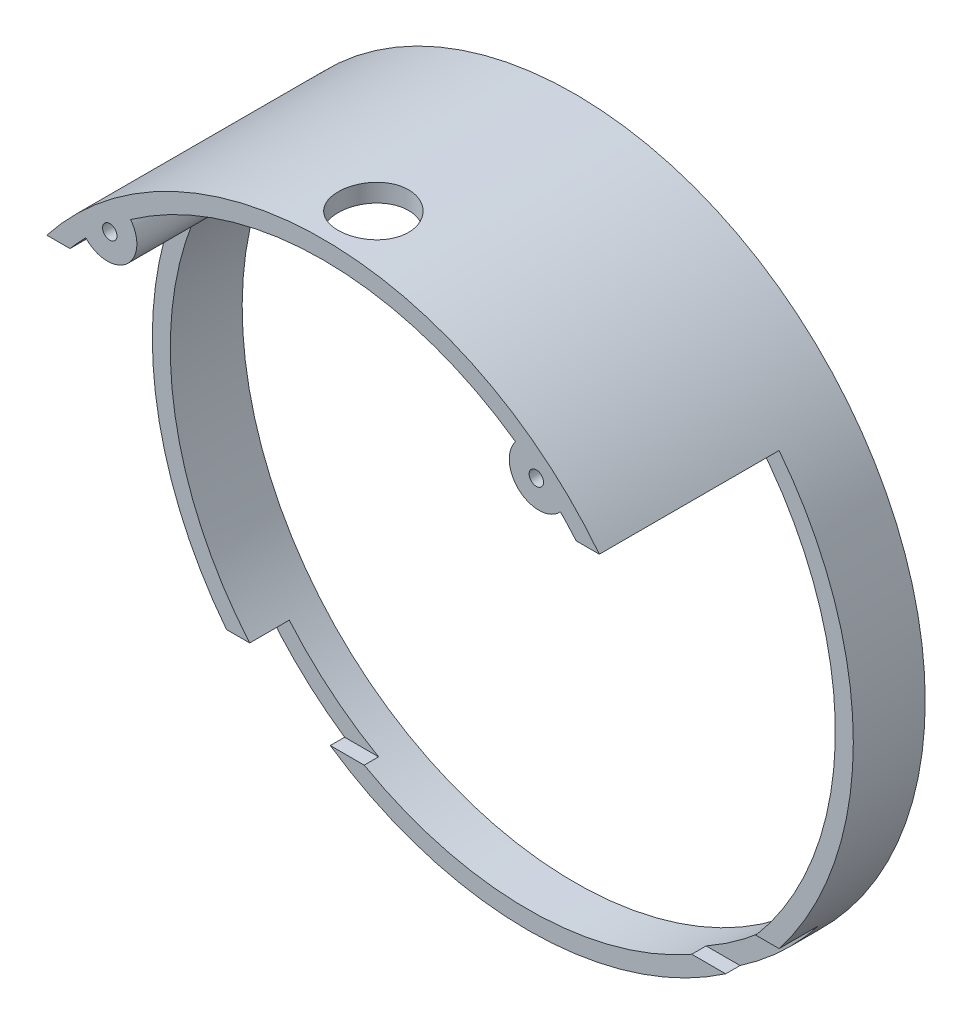
ISO-10303-21;
HEADER;
FILE_DESCRIPTION(('STEP AP214'),'2;1');
FILE_NAME('part.step','',(''),(''),'','','');
FILE_SCHEMA(('AUTOMOTIVE_DESIGN { 1 0 10303 214 1 1 1 1 }'));
ENDSEC;
DATA;
#1=APPLICATION_CONTEXT('core data for automotive mechanical design processes');
#2=APPLICATION_PROTOCOL_DEFINITION('international standard','automotive_design',2000,#1);
#3=PRODUCT_CONTEXT('',#1,'mechanical');
#4=PRODUCT('Part','Part','',(#3));
#5=PRODUCT_RELATED_PRODUCT_CATEGORY('part','',(#4));
#6=PRODUCT_DEFINITION_FORMATION('','',#4);
#7=PRODUCT_DEFINITION_CONTEXT('part definition',#1,'design');
#8=PRODUCT_DEFINITION('design','',#6,#7);
#9=PRODUCT_DEFINITION_SHAPE('','',#8);
#10=(LENGTH_UNIT() NAMED_UNIT(*) SI_UNIT(.MILLI.,.METRE.));
#11=(NAMED_UNIT(*) PLANE_ANGLE_UNIT() SI_UNIT($,.RADIAN.));
#12=(NAMED_UNIT(*) SI_UNIT($,.STERADIAN.) SOLID_ANGLE_UNIT());
#13=UNCERTAINTY_MEASURE_WITH_UNIT(LENGTH_MEASURE(1.E-05),#10,'distance_accuracy_value','');
#14=(GEOMETRIC_REPRESENTATION_CONTEXT(3) GLOBAL_UNCERTAINTY_ASSIGNED_CONTEXT((#13)) GLOBAL_UNIT_ASSIGNED_CONTEXT((#10,
#11,#12)) REPRESENTATION_CONTEXT('',''));
#15=CARTESIAN_POINT('',(0.,0.,0.));
#16=DIRECTION('',(0.,0.,1.));
#17=DIRECTION('',(1.,0.,0.));
#18=AXIS2_PLACEMENT_3D('',#15,#16,#17);
#19=CARTESIAN_POINT('',(0.,0.,70.));
#20=DIRECTION('',(0.,0.,-1.));
#21=DIRECTION('',(-1.,0.,0.));
#22=AXIS2_PLACEMENT_3D('',#19,#20,#21);
#23=CYLINDRICAL_SURFACE('',#22,92.5);
#24=DIRECTION('',(0.,0.,-1.));
#25=VECTOR('',#24,1.);
#26=CARTESIAN_POINT('',(-53.5301809649101,75.4371906016123,70.));
#27=LINE('',#26,#25);
#28=CARTESIAN_POINT('',(-53.5301809649101,75.4371906016123,70.));
#29=VERTEX_POINT('',#28);
#30=CARTESIAN_POINT('',(-53.5301809649101,75.4371906016123,0.));
#31=VERTEX_POINT('',#30);
#32=EDGE_CURVE('E169',#29,#31,#27,.T.);
#33=ORIENTED_EDGE('',*,*,#32,.T.);
#34=CARTESIAN_POINT('',(0.,0.,0.));
#35=DIRECTION('',(0.,0.,1.));
#36=DIRECTION('',(1.,0.,0.));
#37=AXIS2_PLACEMENT_3D('',#34,#35,#36);
#38=CIRCLE('',#37,92.5);
#39=CARTESIAN_POINT('',(53.53018096491,75.4371906016123,0.));
#40=VERTEX_POINT('',#39);
#41=EDGE_CURVE('E193',#40,#31,#38,.T.);
#42=ORIENTED_EDGE('',*,*,#41,.F.);
#43=DIRECTION('',(0.,0.,-1.));
#44=VECTOR('',#43,1.);
#45=CARTESIAN_POINT('',(53.5301809649101,75.4371906016123,70.));
#46=LINE('',#45,#44);
#47=CARTESIAN_POINT('',(53.5301809649101,75.4371906016123,70.));
#48=VERTEX_POINT('',#47);
#49=EDGE_CURVE('E74',#48,#40,#46,.T.);
#50=ORIENTED_EDGE('',*,*,#49,.F.);
#51=CARTESIAN_POINT('',(0.,0.,70.));
#52=DIRECTION('',(0.,0.,1.));
#53=DIRECTION('',(1.,0.,0.));
#54=AXIS2_PLACEMENT_3D('',#51,#52,#53);
#55=CIRCLE('',#54,92.5);
#56=EDGE_CURVE('E192',#48,#29,#55,.T.);
#57=ORIENTED_EDGE('',*,*,#56,.T.);
#58=EDGE_LOOP('',(#33,#42,#50,#57));
#59=FACE_BOUND('',#58,.T.);
#60=CARTESIAN_POINT('',(0.,92.5,46.2285683290803));
#61=CARTESIAN_POINT('',(-0.27406969220594,92.5000007989839,46.2285655417889));
#62=CARTESIAN_POINT('',(-0.548097186362277,92.4987794843781,46.2400881531365));
#63=CARTESIAN_POINT('',(-1.09428440341612,92.4939300549302,46.2860924347904));
#64=CARTESIAN_POINT('',(-1.36644366809463,92.4903013695458,46.3205795476464));
#65=CARTESIAN_POINT('',(-1.90712093368535,92.4807335926465,46.4123119616539));
#66=CARTESIAN_POINT('',(-2.17563518528556,92.4747922848945,46.4695790945601));
#67=CARTESIAN_POINT('',(-2.706857820496,92.4607674705232,46.6064516950649));
#68=CARTESIAN_POINT('',(-2.96956609095208,92.452683922193,46.6860575976158));
#69=CARTESIAN_POINT('',(-3.48714303905029,92.4346085216811,46.8669698454501));
#70=CARTESIAN_POINT('',(-3.74201663087301,92.4246178952618,46.9682622569231));
#71=CARTESIAN_POINT('',(-4.24231083342059,92.4030058922651,47.1918487967306));
#72=CARTESIAN_POINT('',(-4.48773131248162,92.3913844929846,47.3141432174536));
#73=CARTESIAN_POINT('',(-4.96734746052684,92.3668399123357,47.5788315402661));
#74=CARTESIAN_POINT('',(-5.20154543925905,92.3539170005499,47.7212212824495));
#75=CARTESIAN_POINT('',(-5.65713914014016,92.3271295884539,48.0251114319262));
#76=CARTESIAN_POINT('',(-5.87853480891222,92.3132650842185,48.1866119188897));
#77=CARTESIAN_POINT('',(-6.30774763500198,92.2849324174231,48.5281966013601));
#78=CARTESIAN_POINT('',(-6.51551359268131,92.2704622797452,48.7083449704881));
#79=CARTESIAN_POINT('',(-6.91514625263725,92.2413730482906,49.0854786614535));
#80=CARTESIAN_POINT('',(-7.10701290558853,92.2267539540521,49.2824640355214));
#81=CARTESIAN_POINT('',(-7.47351126335919,92.1977788914203,49.6919026696128));
#82=CARTESIAN_POINT('',(-7.64814197003356,92.183422938305,49.904356824207));
#83=CARTESIAN_POINT('',(-7.97892141985071,92.1553816846484,50.3432305479264));
#84=CARTESIAN_POINT('',(-8.1350705732509,92.1416963692241,50.5696498068813));
#85=CARTESIAN_POINT('',(-8.4281356775667,92.1153528822691,51.0354306381323));
#86=CARTESIAN_POINT('',(-8.56500456102325,92.1026972551679,51.2748219727617));
#87=CARTESIAN_POINT('',(-8.81808005254585,92.078812048342,51.7643574926514));
#88=CARTESIAN_POINT('',(-8.93428661704221,92.0675824716244,52.0145017005844));
#89=CARTESIAN_POINT('',(-9.14519248082353,92.0468722459027,52.5237628303334));
#90=CARTESIAN_POINT('',(-9.23989224392225,92.0373915591832,52.7828795585098));
#91=CARTESIAN_POINT('',(-9.40709457049108,92.0204522909088,53.3082427779333));
#92=CARTESIAN_POINT('',(-9.47959722318577,92.0129937012258,53.5744892405167));
#93=CARTESIAN_POINT('',(-9.60164108013783,92.0003382745611,54.1111932312065));
#94=CARTESIAN_POINT('',(-9.65126755520722,91.995133042695,54.3816311724906));
#95=CARTESIAN_POINT('',(-9.7275939230695,91.9870936201206,54.9257582604259));
#96=CARTESIAN_POINT('',(-9.7542938673461,91.984259424088,55.1994473997748));
#97=CARTESIAN_POINT('',(-9.78456920140516,91.9810439094084,55.7481089753324));
#98=CARTESIAN_POINT('',(-9.78814519161799,91.9806625270722,56.0230813780348));
#99=CARTESIAN_POINT('',(-9.77214765640751,91.9823634963698,56.5723439315571));
#100=CARTESIAN_POINT('',(-9.75257418133349,91.9844458426451,56.8466340838597));
#101=CARTESIAN_POINT('',(-9.69054960661146,91.9910007186085,57.391454019865));
#102=CARTESIAN_POINT('',(-9.64819194424969,91.9954634856393,57.6619945647533));
#103=CARTESIAN_POINT('',(-9.54096970526183,92.0066454022502,58.1985295519864));
#104=CARTESIAN_POINT('',(-9.47610519931168,92.013364544745,58.4645240086039));
#105=CARTESIAN_POINT('',(-9.32434052186182,92.0288676769386,58.9900910248777));
#106=CARTESIAN_POINT('',(-9.23744011649031,92.0376516885522,59.2496635163443));
#107=CARTESIAN_POINT('',(-9.04223136508925,92.0570348467386,59.7605596142444));
#108=CARTESIAN_POINT('',(-8.93392295478331,92.0676339987612,60.0118831959084));
#109=CARTESIAN_POINT('',(-8.69643695631195,92.0903699256598,60.5050143201858));
#110=CARTESIAN_POINT('',(-8.56721822217638,92.1025097217403,60.7468019073466));
#111=CARTESIAN_POINT('',(-8.28898602505182,92.1279665257496,61.2186402343905));
#112=CARTESIAN_POINT('',(-8.1399725452263,92.1412835346799,61.4486909642905));
#113=CARTESIAN_POINT('',(-7.82319864772347,92.1687193564254,61.8954597899381));
#114=CARTESIAN_POINT('',(-7.6554377103654,92.1828381914621,62.1121775158356));
#115=CARTESIAN_POINT('',(-7.30234836008134,92.2114801480191,62.5307670552935));
#116=CARTESIAN_POINT('',(-7.11701988923151,92.2260032708724,62.7326388198998));
#117=CARTESIAN_POINT('',(-6.72913140427679,92.2551179723705,63.1210899374903));
#118=CARTESIAN_POINT('',(-6.52649076826658,92.2697095346693,63.3075887962556));
#119=CARTESIAN_POINT('',(-6.10619656899307,92.2984762684091,63.6628610401235));
#120=CARTESIAN_POINT('',(-5.88854295320672,92.3126514383931,63.831634363208));
#121=CARTESIAN_POINT('',(-5.43975062519075,92.3401843501077,64.1502603727402));
#122=CARTESIAN_POINT('',(-5.20861186716754,92.3535420890621,64.3001129949304));
#123=CARTESIAN_POINT('',(-4.73447622259631,92.3790619613319,64.5798276712287));
#124=CARTESIAN_POINT('',(-4.49147935332046,92.3912240963886,64.7096897544533));
#125=CARTESIAN_POINT('',(-3.99529033709349,92.4140105162186,64.9485145197897));
#126=CARTESIAN_POINT('',(-3.74209605851875,92.4246344773035,65.0574728045363));
#127=CARTESIAN_POINT('',(-3.22735654221607,92.4440398037827,65.2536648089253));
#128=CARTESIAN_POINT('',(-2.96581129859502,92.4528211678767,65.3408985132366));
#129=CARTESIAN_POINT('',(-2.43624287934939,92.4682912306213,65.4930000756549));
#130=CARTESIAN_POINT('',(-2.16821988115608,92.4749799865205,65.5578685456235));
#131=CARTESIAN_POINT('',(-1.62761065062914,92.4860744832627,65.6647638352684));
#132=CARTESIAN_POINT('',(-1.35502443734775,92.4904802336353,65.7067907502877));
#133=CARTESIAN_POINT('',(-0.808566380889529,92.4968676486193,65.7675449583867));
#134=CARTESIAN_POINT('',(-0.534707003756361,92.4988608562629,65.7863832071868));
#135=CARTESIAN_POINT('',(0.0136327554103703,92.5004053088431,65.8009895611197));
#136=CARTESIAN_POINT('',(0.288113135462037,92.4999565615621,65.7967577397758));
#137=CARTESIAN_POINT('',(0.835729478717368,92.4966298333774,65.7652555363056));
#138=CARTESIAN_POINT('',(1.10886546137276,92.4937518877256,65.7379854885046));
#139=CARTESIAN_POINT('',(1.65184761187557,92.485648217603,65.6606083088211));
#140=CARTESIAN_POINT('',(1.92169378089491,92.4804224939683,65.6105011850739));
#141=CARTESIAN_POINT('',(2.45555266304106,92.4677856993771,65.4879608132153));
#142=CARTESIAN_POINT('',(2.71957750009178,92.4603797471719,65.4155798419126));
#143=CARTESIAN_POINT('',(3.24057847800646,92.4435859775169,65.2489789226184));
#144=CARTESIAN_POINT('',(3.49755463368988,92.4341981642341,65.1547590205459));
#145=CARTESIAN_POINT('',(4.00265725569069,92.4137036947726,64.9451576897204));
#146=CARTESIAN_POINT('',(4.2507836514391,92.4025970248912,64.8297760922667));
#147=CARTESIAN_POINT('',(4.7364582629205,92.3789753322488,64.5786721793576));
#148=CARTESIAN_POINT('',(4.97400619878437,92.3664602722575,64.4429493261578));
#149=CARTESIAN_POINT('',(5.43772952498193,92.3403229275863,64.1515821255157));
#150=CARTESIAN_POINT('',(5.66385919846764,92.3266966876751,63.9958653703149));
#151=CARTESIAN_POINT('',(6.10221166657543,92.2987608646338,63.6660089316998));
#152=CARTESIAN_POINT('',(6.3144344304849,92.2844512799947,63.4918692076018));
#153=CARTESIAN_POINT('',(6.72349990141039,92.2555505313245,63.1263832898726));
#154=CARTESIAN_POINT('',(6.92034205401423,92.2409593571668,62.935036476526));
#155=CARTESIAN_POINT('',(7.29725884703962,92.2119067756938,62.5364840378994));
#156=CARTESIAN_POINT('',(7.47733382432471,92.1974453657766,62.3292787313794));
#157=CARTESIAN_POINT('',(7.82015324098374,92.1690019343198,61.8995805083395));
#158=CARTESIAN_POINT('',(7.98282440755209,92.1550220956483,61.6770289812157));
#159=CARTESIAN_POINT('',(8.28883878191713,92.1280020195689,61.2189570053278));
#160=CARTESIAN_POINT('',(8.43218192949861,92.1149617850883,60.9834365161631));
#161=CARTESIAN_POINT('',(8.69851167541715,92.0901937805399,60.5010905185128));
#162=CARTESIAN_POINT('',(8.8214984907846,92.0784659964798,60.2542651305912));
#163=CARTESIAN_POINT('',(9.0462282494159,92.0566592271966,59.7510552865492));
#164=CARTESIAN_POINT('',(9.14797125698208,92.0465802369829,59.4946708593656));
#165=CARTESIAN_POINT('',(9.32929464417637,92.0283790725921,58.9746749904812));
#166=CARTESIAN_POINT('',(9.40891786841708,92.0202531196835,58.7110786217906));
#167=CARTESIAN_POINT('',(9.54568114878361,92.0061666577466,58.1780591088804));
#168=CARTESIAN_POINT('',(9.602821223853,92.0002061468937,57.9086359695704));
#169=CARTESIAN_POINT('',(9.69419520750567,91.990622856697,57.3658991113282));
#170=CARTESIAN_POINT('',(9.72842973825149,91.9870000138573,57.0925854982754));
#171=CARTESIAN_POINT('',(9.7737409873063,91.9821966930733,56.5440243292454));
#172=CARTESIAN_POINT('',(9.78481778788361,91.9810162064527,56.268776780142));
#173=CARTESIAN_POINT('',(9.78373426770058,91.9811314502323,55.7196911310853));
#174=CARTESIAN_POINT('',(9.77168863927308,91.9824149586778,55.4458527952004));
#175=CARTESIAN_POINT('',(9.72467594885293,91.9873971514855,54.9001738706141));
#176=CARTESIAN_POINT('',(9.68970896762894,91.9910958273372,54.6283332748766));
#177=CARTESIAN_POINT('',(9.59711051187029,92.0008023498292,54.0885829002618));
#178=CARTESIAN_POINT('',(9.53947906316088,92.0068101938383,53.8206731169059));
#179=CARTESIAN_POINT('',(9.40197266710117,92.0209632707992,53.2906820749926));
#180=CARTESIAN_POINT('',(9.32209768708751,92.0291085068896,53.0286008249947));
#181=CARTESIAN_POINT('',(9.14070020792921,92.0473025128028,52.5121630435546));
#182=CARTESIAN_POINT('',(9.03918166178656,92.0573509349886,52.2578051111964));
#183=CARTESIAN_POINT('',(8.81521822965255,92.0790669853076,51.758548243759));
#184=CARTESIAN_POINT('',(8.6927733545772,92.0907346125962,51.5136493037457));
#185=CARTESIAN_POINT('',(8.42785996541196,92.1153562616959,51.0350747515864));
#186=CARTESIAN_POINT('',(8.28539607089423,92.1283099865266,50.801396566793));
#187=CARTESIAN_POINT('',(7.98136079951616,92.1551472767832,50.3467250416461));
#188=CARTESIAN_POINT('',(7.81978086844082,92.169031257274,50.1257374463953));
#189=CARTESIAN_POINT('',(7.47788586767048,92.1974011348226,49.6970767932787));
#190=CARTESIAN_POINT('',(7.29748541099869,92.2118895788393,49.4894720019875));
#191=CARTESIAN_POINT('',(6.91993971685446,92.2409901025349,49.0902698872862));
#192=CARTESIAN_POINT('',(6.72280162954939,92.2556021270433,48.8986657972165));
#193=CARTESIAN_POINT('',(6.31300081149068,92.2845502917054,48.5326254764066));
#194=CARTESIAN_POINT('',(6.10033098339232,92.2988863019034,48.3581971808513));
#195=CARTESIAN_POINT('',(5.66103954269285,92.3268707401442,48.0278409226));
#196=CARTESIAN_POINT('',(5.43441812452658,92.3405191777644,47.8719127021682));
#197=CARTESIAN_POINT('',(4.96815518734324,92.3667802688195,47.5792500540997));
#198=CARTESIAN_POINT('',(4.72847894370571,92.3793899107904,47.442570668499));
#199=CARTESIAN_POINT('',(4.23839027771192,92.4031721895607,47.1899113250031));
#200=CARTESIAN_POINT('',(3.98797799398518,92.4143448449078,47.073931099929));
#201=CARTESIAN_POINT('',(3.47843798606423,92.4349251913546,46.863613238917));
#202=CARTESIAN_POINT('',(3.21931914882895,92.4443346213242,46.7692542597022));
#203=CARTESIAN_POINT('',(2.69406942738071,92.4611326735399,46.6027450093888));
#204=CARTESIAN_POINT('',(2.42794026825552,92.4685217879417,46.5305893289528));
#205=CARTESIAN_POINT('',(1.80537647010362,92.4830561303987,46.3897373538605));
#206=CARTESIAN_POINT('',(1.44700931707808,92.4893845879765,46.3293579235461));
#207=CARTESIAN_POINT('',(0.725736775945465,92.4978559839632,46.2487753515728));
#208=CARTESIAN_POINT('',(0.362831409402938,92.4999989422529,46.2285720190791));
#209=CARTESIAN_POINT('',(0.,92.5,46.2285683290803));
#210=B_SPLINE_CURVE_WITH_KNOTS('',3,(#60,#61,#62,#63,#64,#65,#66,#67,#68,#69,#70,#71,#72,#73,
#74,#75,#76,#77,#78,#79,#80,#81,#82,#83,#84,#85,#86,#87,#88,#89,#90,#91,#92,#93,#94,#95,#96,#97,
#98,#99,#100,#101,#102,#103,#104,#105,#106,#107,#108,#109,#110,#111,#112,#113,#114,#115,#116,
#117,#118,#119,#120,#121,#122,#123,#124,#125,#126,#127,#128,#129,#130,#131,#132,#133,#134,#135,
#136,#137,#138,#139,#140,#141,#142,#143,#144,#145,#146,#147,#148,#149,#150,#151,#152,#153,#154,
#155,#156,#157,#158,#159,#160,#161,#162,#163,#164,#165,#166,#167,#168,#169,#170,#171,#172,#173,
#174,#175,#176,#177,#178,#179,#180,#181,#182,#183,#184,#185,#186,#187,#188,#189,#190,#191,#192,
#193,#194,#195,#196,#197,#198,#199,#200,#201,#202,#203,#204,#205,#206,#207,#208,#209),
.UNSPECIFIED.,.T.,.F.,(4,2,2,2,2,2,2,2,2,2,2,2,2,2,2,2,2,2,2,2,2,2,2,2,2,2,2,2,2,2,2,2,2,2,2,2,
2,2,2,2,2,2,2,2,2,2,2,2,2,2,2,2,2,2,2,2,2,2,2,2,2,2,2,2,2,2,2,2,2,2,2,2,2,2,4),(0.,
0.821891734809864,1.64397832599391,2.46685468826574,3.28974707365395,4.11211232025677,
4.93448901669944,5.75669572304771,6.57890585718727,7.40404600293067,8.22918870845838,
9.05437917054177,9.8795513114363,10.7067042104395,11.5338588536013,12.3609956567254,
13.1881291350067,14.0121540385976,14.836177091757,15.6601787484701,16.4841786130111,
17.3048247579862,18.1254683259936,18.9461206040348,19.7667753460788,20.5890650067405,
21.4113553668096,22.2336685264789,23.0559843975811,23.8823636177804,24.708745729222,
25.5351306471012,26.361514361329,27.1880717251511,28.0146296722714,28.8411650048615,
29.6676968873816,30.49025831827,31.3128171276924,32.1353640005402,32.9579105803692,
33.7785411767738,34.5991700477165,35.4198054609845,36.2404625725178,37.0641802526206,
37.8878997517943,38.7116489292185,39.5353815534089,40.3624560132685,41.1895330497666,
42.0166012677597,42.8436669822853,43.6691193727852,44.4945710677845,45.320000340877,
46.1454266816095,46.9667693036741,47.7881090315648,48.6094478235743,49.4307878216794,
50.2519779377611,51.0731676254783,51.8941681263926,52.7155374155582,53.5408101532066,
54.3657320986267,55.1910333857285,56.0163231737096,56.8439269372518,57.6715200175454,
58.4982925908361,59.3248635797046,60.4129428583833,61.5010169687217),.UNSPECIFIED.);
#211=CARTESIAN_POINT('',(0.,92.5,46.2285683290803));
#212=VERTEX_POINT('',#211);
#213=EDGE_CURVE('E48',#212,#212,#210,.T.);
#214=ORIENTED_EDGE('',*,*,#213,.T.);
#215=EDGE_LOOP('',(#214));
#216=FACE_BOUND('',#215,.T.);
#217=ADVANCED_FACE('F43',(#59,#216),#23,.F.);
#218=DIRECTION('',(0.,0.,-1.));
#219=VECTOR('',#218,1.);
#220=CARTESIAN_POINT('',(-66.0209995997427,64.7879434142709,70.));
#221=LINE('',#220,#219);
#222=CARTESIAN_POINT('',(-66.0209995997427,64.7879434142709,70.));
#223=VERTEX_POINT('',#222);
#224=CARTESIAN_POINT('',(-66.0209995997428,64.7879434142709,0.));
#225=VERTEX_POINT('',#224);
#226=EDGE_CURVE('E166',#223,#225,#221,.T.);
#227=ORIENTED_EDGE('',*,*,#226,.F.);
#228=CARTESIAN_POINT('',(-70.4006392016436,60.,70.));
#229=VERTEX_POINT('',#228);
#230=EDGE_CURVE('E179',#223,#229,#55,.T.);
#231=ORIENTED_EDGE('',*,*,#230,.T.);
#232=DIRECTION('',(0.,0.,-1.));
#233=VECTOR('',#232,1.);
#234=CARTESIAN_POINT('',(-70.4006392016436,60.,70.));
#235=LINE('',#234,#233);
#236=CARTESIAN_POINT('',(-70.4006392016436,60.,20.));
#237=VERTEX_POINT('',#236);
#238=EDGE_CURVE('E218',#237,#229,#235,.F.);
#239=ORIENTED_EDGE('',*,*,#238,.F.);
#240=CARTESIAN_POINT('',(0.,0.,20.));
#241=DIRECTION('',(0.,0.,-1.));
#242=DIRECTION('',(-1.,0.,0.));
#243=AXIS2_PLACEMENT_3D('',#240,#241,#242);
#244=CIRCLE('',#243,92.5);
#245=CARTESIAN_POINT('',(-70.4006392016436,-60.,20.));
#246=VERTEX_POINT('',#245);
#247=EDGE_CURVE('E221',#246,#237,#244,.T.);
#248=ORIENTED_EDGE('',*,*,#247,.F.);
#249=DIRECTION('',(0.,0.,-1.));
#250=VECTOR('',#249,1.);
#251=CARTESIAN_POINT('',(-70.4006392016436,-60.,70.));
#252=LINE('',#251,#250);
#253=CARTESIAN_POINT('',(-70.4006392016436,-60.,9.));
#254=VERTEX_POINT('',#253);
#255=EDGE_CURVE('E267',#254,#246,#252,.F.);
#256=ORIENTED_EDGE('',*,*,#255,.F.);
#257=CARTESIAN_POINT('',(0.,0.,9.));
#258=DIRECTION('',(0.,0.,-1.));
#259=DIRECTION('',(-1.,0.,0.));
#260=AXIS2_PLACEMENT_3D('',#257,#258,#259);
#261=CIRCLE('',#260,92.5);
#262=CARTESIAN_POINT('',(-45.5521678957215,-80.5062109405231,9.));
#263=VERTEX_POINT('',#262);
#264=EDGE_CURVE('E11',#263,#254,#261,.T.);
#265=ORIENTED_EDGE('',*,*,#264,.F.);
#266=DIRECTION('',(0.,0.,-1.));
#267=VECTOR('',#266,1.);
#268=CARTESIAN_POINT('',(-45.5521678957215,-80.5062109405231,70.));
#269=LINE('',#268,#267);
#270=CARTESIAN_POINT('',(-45.5521678957215,-80.5062109405231,13.));
#271=VERTEX_POINT('',#270);
#272=EDGE_CURVE('E253',#271,#263,#269,.T.);
#273=ORIENTED_EDGE('',*,*,#272,.F.);
#274=CARTESIAN_POINT('',(0.,0.,13.));
#275=DIRECTION('',(0.,0.,-1.));
#276=DIRECTION('',(-1.,0.,0.));
#277=AXIS2_PLACEMENT_3D('',#274,#275,#276);
#278=CIRCLE('',#277,92.5);
#279=CARTESIAN_POINT('',(45.5521678957215,-80.5062109405231,13.));
#280=VERTEX_POINT('',#279);
#281=EDGE_CURVE('E212',#280,#271,#278,.T.);
#282=ORIENTED_EDGE('',*,*,#281,.F.);
#283=DIRECTION('',(0.,0.,-1.));
#284=VECTOR('',#283,1.);
#285=CARTESIAN_POINT('',(45.5521678957215,-80.5062109405231,70.));
#286=LINE('',#285,#284);
#287=CARTESIAN_POINT('',(45.5521678957215,-80.5062109405231,9.));
#288=VERTEX_POINT('',#287);
#289=EDGE_CURVE('E251',#288,#280,#286,.F.);
#290=ORIENTED_EDGE('',*,*,#289,.F.);
#291=CARTESIAN_POINT('',(70.4006392016436,-60.,9.));
#292=VERTEX_POINT('',#291);
#293=EDGE_CURVE('E59',#292,#288,#261,.T.);
#294=ORIENTED_EDGE('',*,*,#293,.F.);
#295=DIRECTION('',(0.,0.,-1.));
#296=VECTOR('',#295,1.);
#297=CARTESIAN_POINT('',(70.4006392016436,-60.,70.));
#298=LINE('',#297,#296);
#299=CARTESIAN_POINT('',(70.4006392016436,-60.,20.));
#300=VERTEX_POINT('',#299);
#301=EDGE_CURVE('E323',#300,#292,#298,.T.);
#302=ORIENTED_EDGE('',*,*,#301,.F.);
#303=CARTESIAN_POINT('',(70.4006392016436,60.,20.));
#304=VERTEX_POINT('',#303);
#305=EDGE_CURVE('E226',#304,#300,#244,.T.);
#306=ORIENTED_EDGE('',*,*,#305,.F.);
#307=DIRECTION('',(0.,0.,-1.));
#308=VECTOR('',#307,1.);
#309=CARTESIAN_POINT('',(70.4006392016436,60.,70.));
#310=LINE('',#309,#308);
#311=CARTESIAN_POINT('',(70.4006392016436,60.,70.));
#312=VERTEX_POINT('',#311);
#313=EDGE_CURVE('E225',#312,#304,#310,.T.);
#314=ORIENTED_EDGE('',*,*,#313,.F.);
#315=CARTESIAN_POINT('',(66.0209995997427,64.7879434142709,70.));
#316=VERTEX_POINT('',#315);
#317=EDGE_CURVE('E195',#312,#316,#55,.T.);
#318=ORIENTED_EDGE('',*,*,#317,.T.);
#319=DIRECTION('',(0.,0.,-1.));
#320=VECTOR('',#319,1.);
#321=CARTESIAN_POINT('',(66.0209995997427,64.7879434142709,70.));
#322=LINE('',#321,#320);
#323=CARTESIAN_POINT('',(66.0209995997427,64.7879434142709,0.));
#324=VERTEX_POINT('',#323);
#325=EDGE_CURVE('E411',#316,#324,#322,.T.);
#326=ORIENTED_EDGE('',*,*,#325,.T.);
#327=EDGE_CURVE('E182',#225,#324,#38,.T.);
#328=ORIENTED_EDGE('',*,*,#327,.F.);
#329=EDGE_LOOP('',(#227,#231,#239,#248,#256,#265,#273,#282,#290,#294,#302,#306,#314,#318,#326,#328));
#330=FACE_BOUND('',#329,.T.);
#331=ADVANCED_FACE('F177',(#330),#23,.F.);
#332=CARTESIAN_POINT('',(0.,0.,70.));
#333=DIRECTION('',(0.,0.,-1.));
#334=DIRECTION('',(-1.,0.,0.));
#335=AXIS2_PLACEMENT_3D('',#332,#333,#334);
#336=CYLINDRICAL_SURFACE('',#335,97.5);
#337=CARTESIAN_POINT('',(0.,0.,9.));
#338=DIRECTION('',(0.,0.,-1.));
#339=DIRECTION('',(-1.,0.,0.));
#340=AXIS2_PLACEMENT_3D('',#337,#338,#339);
#341=CIRCLE('',#340,97.5);
#342=CARTESIAN_POINT('',(-55.,-80.5062109405231,9.));
#343=VERTEX_POINT('',#342);
#344=CARTESIAN_POINT('',(-76.852130744697,-60.,9.));
#345=VERTEX_POINT('',#344);
#346=EDGE_CURVE('E276',#343,#345,#341,.T.);
#347=ORIENTED_EDGE('',*,*,#346,.T.);
#348=DIRECTION('',(0.,0.,-1.));
#349=VECTOR('',#348,1.);
#350=CARTESIAN_POINT('',(-76.852130744697,-60.,70.));
#351=LINE('',#350,#349);
#352=CARTESIAN_POINT('',(-76.852130744697,-60.,20.));
#353=VERTEX_POINT('',#352);
#354=EDGE_CURVE('E260',#345,#353,#351,.F.);
#355=ORIENTED_EDGE('',*,*,#354,.T.);
#356=CARTESIAN_POINT('',(0.,0.,20.));
#357=DIRECTION('',(0.,0.,-1.));
#358=DIRECTION('',(-1.,0.,0.));
#359=AXIS2_PLACEMENT_3D('',#356,#357,#358);
#360=CIRCLE('',#359,97.5);
#361=CARTESIAN_POINT('',(-76.852130744697,60.,20.));
#362=VERTEX_POINT('',#361);
#363=EDGE_CURVE('E302',#353,#362,#360,.T.);
#364=ORIENTED_EDGE('',*,*,#363,.T.);
#365=DIRECTION('',(0.,0.,-1.));
#366=VECTOR('',#365,1.);
#367=CARTESIAN_POINT('',(-76.852130744697,60.,70.));
#368=LINE('',#367,#366);
#369=CARTESIAN_POINT('',(-76.852130744697,60.,70.));
#370=VERTEX_POINT('',#369);
#371=EDGE_CURVE('E293',#362,#370,#368,.F.);
#372=ORIENTED_EDGE('',*,*,#371,.T.);
#373=CARTESIAN_POINT('',(0.,0.,70.));
#374=DIRECTION('',(0.,0.,1.));
#375=DIRECTION('',(1.,0.,0.));
#376=AXIS2_PLACEMENT_3D('',#373,#374,#375);
#377=CIRCLE('',#376,97.5);
#378=CARTESIAN_POINT('',(76.852130744697,60.,70.));
#379=VERTEX_POINT('',#378);
#380=EDGE_CURVE('E207',#379,#370,#377,.T.);
#381=ORIENTED_EDGE('',*,*,#380,.F.);
#382=DIRECTION('',(0.,0.,-1.));
#383=VECTOR('',#382,1.);
#384=CARTESIAN_POINT('',(76.852130744697,60.,70.));
#385=LINE('',#384,#383);
#386=CARTESIAN_POINT('',(76.852130744697,60.,20.));
#387=VERTEX_POINT('',#386);
#388=EDGE_CURVE('E298',#379,#387,#385,.T.);
#389=ORIENTED_EDGE('',*,*,#388,.T.);
#390=CARTESIAN_POINT('',(76.852130744697,-60.,20.));
#391=VERTEX_POINT('',#390);
#392=EDGE_CURVE('E304',#387,#391,#360,.T.);
#393=ORIENTED_EDGE('',*,*,#392,.T.);
#394=DIRECTION('',(0.,0.,-1.));
#395=VECTOR('',#394,1.);
#396=CARTESIAN_POINT('',(76.852130744697,-60.,70.));
#397=LINE('',#396,#395);
#398=CARTESIAN_POINT('',(76.852130744697,-60.,9.));
#399=VERTEX_POINT('',#398);
#400=EDGE_CURVE('E312',#391,#399,#397,.T.);
#401=ORIENTED_EDGE('',*,*,#400,.T.);
#402=CARTESIAN_POINT('',(55.,-80.5062109405231,9.));
#403=VERTEX_POINT('',#402);
#404=EDGE_CURVE('E280',#399,#403,#341,.T.);
#405=ORIENTED_EDGE('',*,*,#404,.T.);
#406=DIRECTION('',(0.,0.,-1.));
#407=VECTOR('',#406,1.);
#408=CARTESIAN_POINT('',(55.,-80.5062109405231,70.));
#409=LINE('',#408,#407);
#410=CARTESIAN_POINT('',(55.,-80.5062109405231,13.));
#411=VERTEX_POINT('',#410);
#412=EDGE_CURVE('E273',#403,#411,#409,.F.);
#413=ORIENTED_EDGE('',*,*,#412,.T.);
#414=CARTESIAN_POINT('',(0.,0.,13.));
#415=DIRECTION('',(0.,0.,-1.));
#416=DIRECTION('',(-1.,0.,0.));
#417=AXIS2_PLACEMENT_3D('',#414,#415,#416);
#418=CIRCLE('',#417,97.5);
#419=CARTESIAN_POINT('',(-55.,-80.5062109405231,13.));
#420=VERTEX_POINT('',#419);
#421=EDGE_CURVE('E246',#411,#420,#418,.T.);
#422=ORIENTED_EDGE('',*,*,#421,.T.);
#423=DIRECTION('',(0.,0.,-1.));
#424=VECTOR('',#423,1.);
#425=CARTESIAN_POINT('',(-55.,-80.5062109405231,70.));
#426=LINE('',#425,#424);
#427=EDGE_CURVE('E259',#420,#343,#426,.T.);
#428=ORIENTED_EDGE('',*,*,#427,.T.);
#429=EDGE_LOOP('',(#347,#355,#364,#372,#381,#389,#393,#401,#405,#413,#422,#428));
#430=FACE_BOUND('',#429,.T.);
#431=CARTESIAN_POINT('',(0.,0.,0.));
#432=DIRECTION('',(0.,0.,1.));
#433=DIRECTION('',(1.,0.,0.));
#434=AXIS2_PLACEMENT_3D('',#431,#432,#433);
#435=CIRCLE('',#434,97.5);
#436=CARTESIAN_POINT('',(97.5,0.,0.));
#437=VERTEX_POINT('',#436);
#438=EDGE_CURVE('E202',#437,#437,#435,.T.);
#439=ORIENTED_EDGE('',*,*,#438,.T.);
#440=EDGE_LOOP('',(#439));
#441=FACE_BOUND('',#440,.T.);
#442=CARTESIAN_POINT('',(0.,97.5,46.2285683290803));
#443=CARTESIAN_POINT('',(-0.274151647138005,97.5000007364753,46.2285656281549));
#444=CARTESIAN_POINT('',(-0.548262081894577,97.4988413707067,46.2400950892385));
#445=CARTESIAN_POINT('',(-1.09461575895637,97.4942378715625,46.2861273026148));
#446=CARTESIAN_POINT('',(-1.36685853795423,97.4907931906038,46.3206355608513));
#447=CARTESIAN_POINT('',(-1.90770627131856,97.4817105772297,46.4124256880567));
#448=CARTESIAN_POINT('',(-2.17630743563854,97.4760705178707,46.4697296433177));
#449=CARTESIAN_POINT('',(-2.70770335865098,97.4627569089979,46.6066922777083));
#450=CARTESIAN_POINT('',(-2.97049800535553,97.4550833203015,46.6863513875873));
#451=CARTESIAN_POINT('',(-3.48824936643807,97.4379247184749,46.8673886025577));
#452=CARTESIAN_POINT('',(-3.7432108864106,97.4284408427963,46.9687530744378));
#453=CARTESIAN_POINT('',(-4.24367626196839,97.4079254589792,47.1925021485432));
#454=CARTESIAN_POINT('',(-4.48917998405435,97.3968939290053,47.3148870473443));
#455=CARTESIAN_POINT('',(-4.96895344003094,97.373595910043,47.5797738410022));
#456=CARTESIAN_POINT('',(-5.20322554036309,97.3613296829017,47.7222714730395));
#457=CARTESIAN_POINT('',(-5.65895585267615,97.3359045434463,48.0263942297537));
#458=CARTESIAN_POINT('',(-5.88041401657207,97.3227456277828,48.1880194262008));
#459=CARTESIAN_POINT('',(-6.30966322708426,97.2958609270331,48.5298102296241));
#460=CARTESIAN_POINT('',(-6.51740795171736,97.2821334524991,48.7100338814473));
#461=CARTESIAN_POINT('',(-6.91699041355882,97.2545390300021,49.0873187243632));
#462=CARTESIAN_POINT('',(-7.108828104691,97.2406720816352,49.2843799642242));
#463=CARTESIAN_POINT('',(-7.47525901470767,97.2131898065067,49.6939682393041));
#464=CARTESIAN_POINT('',(-7.64985125122777,97.1995744941149,49.9064961543652));
#465=CARTESIAN_POINT('',(-7.98054360823927,97.1729820990114,50.3455126650102));
#466=CARTESIAN_POINT('',(-8.13664413713941,97.1600050022078,50.5720009520966));
#467=CARTESIAN_POINT('',(-8.42956569075164,97.1350301687484,51.0378550925759));
#468=CARTESIAN_POINT('',(-8.56634445429987,97.1230346023036,51.2772476386843));
#469=CARTESIAN_POINT('',(-8.81924080698056,97.1003971074779,51.7667705946673));
#470=CARTESIAN_POINT('',(-8.93535835692757,97.0897551816643,52.016901024906));
#471=CARTESIAN_POINT('',(-9.14608978786722,97.0701305655364,52.5261198044714));
#472=CARTESIAN_POINT('',(-9.24070408954811,97.0611478427621,52.7852079784352));
#473=CARTESIAN_POINT('',(-9.40774139968357,97.0451000753224,53.3104995799043));
#474=CARTESIAN_POINT('',(-9.48016448830955,97.0380350237288,53.5767029817004));
#475=CARTESIAN_POINT('',(-9.60208065693934,97.0260469704128,54.1134085274495));
#476=CARTESIAN_POINT('',(-9.6516505388924,97.0211167975251,54.3838930662143));
#477=CARTESIAN_POINT('',(-9.72785686964112,97.0135056094167,54.9281051523826));
#478=CARTESIAN_POINT('',(-9.75449336482111,97.0108245896471,55.2018326932259));
#479=CARTESIAN_POINT('',(-9.78463623785099,97.0077889889495,55.7505647870078));
#480=CARTESIAN_POINT('',(-9.78814316016219,97.0074343532593,56.0255693097343));
#481=CARTESIAN_POINT('',(-9.77200240066376,97.009061609433,56.5748907368997));
#482=CARTESIAN_POINT('',(-9.75235476405305,97.0110434967358,56.8492076426798));
#483=CARTESIAN_POINT('',(-9.69016416467502,97.0172752037704,57.3941896942646));
#484=CARTESIAN_POINT('',(-9.64770521341875,97.0215167011331,57.6648645274045));
#485=CARTESIAN_POINT('',(-9.5402561884874,97.0321411804971,58.2016606893962));
#486=CARTESIAN_POINT('',(-9.47526617841156,97.0385241564536,58.4677820310991));
#487=CARTESIAN_POINT('',(-9.32322616670987,97.0532497186954,58.9935930541339));
#488=CARTESIAN_POINT('',(-9.23617595144076,97.0615923239587,59.2532826731506));
#489=CARTESIAN_POINT('',(-9.0406433350991,97.0800000172206,59.7644005908044));
#490=CARTESIAN_POINT('',(-8.93216087602336,97.0900651098808,60.0158288670812));
#491=CARTESIAN_POINT('',(-8.69432610695048,97.1116520726759,60.5091053821851));
#492=CARTESIAN_POINT('',(-8.56493664974876,97.1231765277489,60.7509355966396));
#493=CARTESIAN_POINT('',(-8.28634849599828,97.1473415364647,61.2228438565825));
#494=CARTESIAN_POINT('',(-8.13714978420973,97.1599820909662,61.4529218930296));
#495=CARTESIAN_POINT('',(-7.81999335420498,97.1860227126302,61.8997258547775));
#496=CARTESIAN_POINT('',(-7.65203516811851,97.1994227987317,62.1164514468527));
#497=CARTESIAN_POINT('',(-7.29854193628392,97.2266048936958,62.5350344437165));
#498=CARTESIAN_POINT('',(-7.1130068384416,97.2403869036903,62.7368918044357));
#499=CARTESIAN_POINT('',(-6.72479495880848,97.268006853658,63.1251923487374));
#500=CARTESIAN_POINT('',(-6.52204566106088,97.2818447699906,63.3115630424633));
#501=CARTESIAN_POINT('',(-6.10154739520996,97.3091234128885,63.6665693935446));
#502=CARTESIAN_POINT('',(-5.88379837987708,97.322564138203,63.8352049950533));
#503=CARTESIAN_POINT('',(-5.43483117015372,97.3486680078038,64.1535464453813));
#504=CARTESIAN_POINT('',(-5.20361293536348,97.3613311497576,64.303252237418));
#505=CARTESIAN_POINT('',(-4.72933647349918,97.3855212408303,64.5826655999374));
#506=CARTESIAN_POINT('',(-4.48627826202808,97.3970481914463,64.7123731967732));
#507=CARTESIAN_POINT('',(-3.98999366040696,97.4186411518293,64.9508799583309));
#508=CARTESIAN_POINT('',(-3.73676543761335,97.4287068967642,65.0596753340321));
#509=CARTESIAN_POINT('',(-3.22197915488769,97.4470891213574,65.2555400275852));
#510=CARTESIAN_POINT('',(-2.96042108971393,97.455405599915,65.3426093317654));
#511=CARTESIAN_POINT('',(-2.43084691750029,97.4700525355302,65.4943838966215));
#512=CARTESIAN_POINT('',(-2.16283096962052,97.4763830414801,65.5590897078633));
#513=CARTESIAN_POINT('',(-1.62225478536656,97.4868779228039,65.6656641279994));
#514=CARTESIAN_POINT('',(-1.34969456604769,97.4910423063057,65.707532822585));
#515=CARTESIAN_POINT('',(-0.803174397418118,97.4970731177872,65.7679926550809));
#516=CARTESIAN_POINT('',(-0.529225611318994,97.4989494131295,65.7866837521336));
#517=CARTESIAN_POINT('',(0.0192794077746488,97.5003838033446,65.8009822725338));
#518=CARTESIAN_POINT('',(0.293835639022969,97.4999419048726,65.7965897621529));
#519=CARTESIAN_POINT('',(0.841591018279035,97.4967524422563,65.7647536855607));
#520=CARTESIAN_POINT('',(1.11479018394857,97.4940049081986,65.7373104201425));
#521=CARTESIAN_POINT('',(1.65788599103911,97.486281959035,65.6595748172521));
#522=CARTESIAN_POINT('',(1.92778263349596,97.4813065446279,65.6092824869466));
#523=CARTESIAN_POINT('',(2.46179374636433,97.4692810910418,65.4863455586453));
#524=CARTESIAN_POINT('',(2.72591912015893,97.4622354084717,65.4137478848343));
#525=CARTESIAN_POINT('',(3.24710386325636,97.4462636274598,65.2466914900045));
#526=CARTESIAN_POINT('',(3.50416324589876,97.4373375325683,65.1522328102592));
#527=CARTESIAN_POINT('',(4.00941168721287,97.4178553461122,64.9421328718509));
#528=CARTESIAN_POINT('',(4.2576006905981,97.4072992443904,64.8264914811897));
#529=CARTESIAN_POINT('',(4.74337676869283,97.3848525605053,64.5748483382853));
#530=CARTESIAN_POINT('',(4.9809635682513,97.3729619437363,64.4388460580295));
#531=CARTESIAN_POINT('',(5.44465312279648,97.3481373682868,64.1469545592556));
#532=CARTESIAN_POINT('',(5.67071452202281,97.3352000318031,63.9909999297066));
#533=CARTESIAN_POINT('',(6.10890923264939,97.3086811055165,63.6606667319081));
#534=CARTESIAN_POINT('',(6.32104251623245,97.2950995144269,63.4862881268642));
#535=CARTESIAN_POINT('',(6.72990506608594,97.2676738194568,63.1203270253563));
#536=CARTESIAN_POINT('',(6.92663381667016,97.2538297068073,62.9287439534117));
#537=CARTESIAN_POINT('',(7.30329873304539,97.2262695826554,62.5297250719387));
#538=CARTESIAN_POINT('',(7.48323523854454,97.2125535685665,62.32228958326));
#539=CARTESIAN_POINT('',(7.82568047352259,97.185587112331,61.8922292575636));
#540=CARTESIAN_POINT('',(7.98812330790063,97.1723385488283,61.6695518258039));
#541=CARTESIAN_POINT('',(8.29367129712795,97.146737108815,61.2112531523956));
#542=CARTESIAN_POINT('',(8.43677639783377,97.1343842348122,60.9756318745083));
#543=CARTESIAN_POINT('',(8.70262286081923,97.1109271459181,60.4931113080727));
#544=CARTESIAN_POINT('',(8.82536442231425,97.0998229188117,60.2462121298855));
#545=CARTESIAN_POINT('',(9.04959949429362,97.079181262849,59.742883192525));
#546=CARTESIAN_POINT('',(9.15109306283442,97.0696438297118,59.4864534593945));
#547=CARTESIAN_POINT('',(9.3319336271062,97.0524253030369,58.966349352155));
#548=CARTESIAN_POINT('',(9.4113195517494,97.0447409496889,58.7026886221844));
#549=CARTESIAN_POINT('',(9.54760324948276,97.0314277218373,58.1695664290931));
#550=CARTESIAN_POINT('',(9.60450103987593,97.0257988457522,57.9001049704356));
#551=CARTESIAN_POINT('',(9.69538894505637,97.0167589789114,57.3573156670074));
#552=CARTESIAN_POINT('',(9.72937961418239,97.0133479344856,57.0839879159621));
#553=CARTESIAN_POINT('',(9.77420423833828,97.0088420771462,56.5354214548857));
#554=CARTESIAN_POINT('',(9.78503826708507,97.0077472568591,56.2601827509407));
#555=CARTESIAN_POINT('',(9.78347322949763,97.0079050957747,55.7109975285193));
#556=CARTESIAN_POINT('',(9.77117728105563,97.0091473359149,55.4370507074901));
#557=CARTESIAN_POINT('',(9.72364552453044,97.0139231577269,54.8911754098322));
#558=CARTESIAN_POINT('',(9.68840978913573,97.0174567321384,54.6192469268107));
#559=CARTESIAN_POINT('',(9.59525650446123,97.0267140505477,54.0793417995649));
#560=CARTESIAN_POINT('',(9.53733897274026,97.0324377928501,53.8113651522815));
#561=CARTESIAN_POINT('',(9.39924401361191,97.0459119136608,53.2812625352661));
#562=CARTESIAN_POINT('',(9.31906655656767,97.0536622948673,53.0191365733241));
#563=CARTESIAN_POINT('',(9.13704539718398,97.0709675993141,52.5026235919491));
#564=CARTESIAN_POINT('',(9.03520484969769,97.0805222597697,52.2482354517958));
#565=CARTESIAN_POINT('',(8.81058185098016,97.1011655921885,51.7489450537738));
#566=CARTESIAN_POINT('',(8.6877994089227,97.1122542634796,51.5040427917498));
#567=CARTESIAN_POINT('',(8.42219801229332,97.1356491710669,51.0254924217012));
#568=CARTESIAN_POINT('',(8.27938374461672,97.1479551223551,50.7918416982555));
#569=CARTESIAN_POINT('',(7.97463739311066,97.1734456467148,50.3372585255849));
#570=CARTESIAN_POINT('',(7.81269675253533,97.1866306118813,50.1163318350846));
#571=CARTESIAN_POINT('',(7.47015537952668,97.2135608261734,49.6879337998786));
#572=CARTESIAN_POINT('',(7.289477952959,97.227308226487,49.4805239093875));
#573=CARTESIAN_POINT('',(6.91139310645759,97.254915282942,49.0817357022259));
#574=CARTESIAN_POINT('',(6.71399283922426,97.2687748888193,48.8903506003796));
#575=CARTESIAN_POINT('',(6.30368574072308,97.2962272169207,48.5247725813249));
#576=CARTESIAN_POINT('',(6.09077180379066,97.3098198131825,48.3505876293558));
#577=CARTESIAN_POINT('',(5.65101463164788,97.3363475040951,48.0207420069126));
#578=CARTESIAN_POINT('',(5.42417159338608,97.3492826080378,47.8650810746122));
#579=CARTESIAN_POINT('',(4.95754924293547,97.3741619813853,47.5730124645568));
#580=CARTESIAN_POINT('',(4.71773835733022,97.3861036345811,47.4366549985555));
#581=CARTESIAN_POINT('',(4.22741517897669,97.4086196723299,47.1846488921863));
#582=CARTESIAN_POINT('',(3.97690302234273,97.4191940742668,47.0689999885139));
#583=CARTESIAN_POINT('',(3.4672015475552,97.4386651659457,46.8593507713722));
#584=CARTESIAN_POINT('',(3.20802114982875,97.4475635215175,46.7653289418719));
#585=CARTESIAN_POINT('',(2.68268443480084,97.4634407540261,46.599494798404));
#586=CARTESIAN_POINT('',(2.41652984751257,97.4704201021449,46.5276770320381));
#587=CARTESIAN_POINT('',(1.7957583910625,97.4840963178125,46.3880107743477));
#588=CARTESIAN_POINT('',(1.43926876147565,97.4900365224706,46.3282773870062));
#589=CARTESIAN_POINT('',(0.721828938356744,97.4979878706628,46.2485580247309));
#590=CARTESIAN_POINT('',(0.360878763388256,97.4999990305428,46.2285718844359));
#591=CARTESIAN_POINT('',(0.,97.5,46.2285683290803));
#592=B_SPLINE_CURVE_WITH_KNOTS('',3,(#442,#443,#444,#445,#446,#447,#448,#449,#450,#451,#452,
#453,#454,#455,#456,#457,#458,#459,#460,#461,#462,#463,#464,#465,#466,#467,#468,#469,#470,#471,
#472,#473,#474,#475,#476,#477,#478,#479,#480,#481,#482,#483,#484,#485,#486,#487,#488,#489,#490,
#491,#492,#493,#494,#495,#496,#497,#498,#499,#500,#501,#502,#503,#504,#505,#506,#507,#508,#509,
#510,#511,#512,#513,#514,#515,#516,#517,#518,#519,#520,#521,#522,#523,#524,#525,#526,#527,#528,
#529,#530,#531,#532,#533,#534,#535,#536,#537,#538,#539,#540,#541,#542,#543,#544,#545,#546,#547,
#548,#549,#550,#551,#552,#553,#554,#555,#556,#557,#558,#559,#560,#561,#562,#563,#564,#565,#566,
#567,#568,#569,#570,#571,#572,#573,#574,#575,#576,#577,#578,#579,#580,#581,#582,#583,#584,#585,
#586,#587,#588,#589,#590,#591),.UNSPECIFIED.,.T.,.F.,(4,2,2,2,2,2,2,2,2,2,2,2,2,2,2,2,2,2,2,2,2,
2,2,2,2,2,2,2,2,2,2,2,2,2,2,2,2,2,2,2,2,2,2,2,2,2,2,2,2,2,2,2,2,2,2,2,2,2,2,2,2,2,2,2,2,2,2,2,2,
2,2,2,2,2,4),(0.,0.822139350479618,1.64447576447638,2.46761087182045,3.29076184079963,
4.11339729453782,4.93604435574,5.75851732102914,6.58099337249301,7.40611876127688,
8.23124654002842,9.05642129401294,9.88157781974922,10.7085120986394,11.5354479458525,
12.36236761355,13.1892842937542,14.0134013557692,14.8375167509483,15.6616127466964,
16.4857071337682,17.3067870728658,18.1278646942907,18.9489502677911,19.7700380634685,
20.5926011291987,21.4151648277523,22.2377490460209,23.0603357023295,23.8865780649487,
24.7128230292736,25.5390704719771,26.3653168258637,27.1917127439527,28.0181091820765,
28.844485273733,29.6708582645746,30.4936547800452,31.3164489333193,32.1392323499769,
32.9620155085598,33.7830794783344,34.6041418979525,35.4252094341206,36.2462982664602,
37.0701514246718,37.8940062282296,38.7178885995873,39.5417543001401,40.3686221213932,
41.1954922577344,42.0223543043729,42.8492140917244,43.6746085365296,44.5000023462518,
45.3253761812159,46.1507473886787,46.9724476506146,47.7941453088712,48.6158423310225,
49.437540447186,50.2591189791064,51.0806971511274,51.9020834161483,52.7238385544498,
53.5491010742148,54.3740123774945,55.1993039159147,56.0245837879283,56.851972395322,
57.6793504819165,58.5059018436875,59.3322500771716,60.4144754424932,61.4966963054033),.UNSPECIFIED.);
#593=CARTESIAN_POINT('',(0.,97.5,46.2285683290803));
#594=VERTEX_POINT('',#593);
#595=EDGE_CURVE('E356',#594,#594,#592,.T.);
#596=ORIENTED_EDGE('',*,*,#595,.F.);
#597=EDGE_LOOP('',(#596));
#598=FACE_BOUND('',#597,.T.);
#599=ADVANCED_FACE('F45',(#430,#441,#598),#336,.T.);
#600=CARTESIAN_POINT('',(0.,0.,70.));
#601=DIRECTION('',(0.,0.,1.));
#602=DIRECTION('',(1.,0.,0.));
#603=AXIS2_PLACEMENT_3D('',#600,#601,#602);
#604=PLANE('',#603);
#605=CARTESIAN_POINT('',(-59.3268975396037,69.5718715027287,70.));
#606=DIRECTION('',(0.,0.,1.));
#607=DIRECTION('',(1.,0.,0.));
#608=AXIS2_PLACEMENT_3D('',#605,#606,#607);
#609=CIRCLE('',#608,2.);
#610=CARTESIAN_POINT('',(-57.3268975396037,69.5718715027287,70.));
#611=VERTEX_POINT('',#610);
#612=EDGE_CURVE('E431',#611,#611,#609,.T.);
#613=ORIENTED_EDGE('',*,*,#612,.F.);
#614=EDGE_LOOP('',(#613));
#615=FACE_BOUND('',#614,.T.);
#616=CARTESIAN_POINT('',(59.3268975396037,69.5718715027287,70.));
#617=DIRECTION('',(0.,0.,-1.));
#618=DIRECTION('',(-1.,0.,0.));
#619=AXIS2_PLACEMENT_3D('',#616,#617,#618);
#620=CIRCLE('',#619,2.);
#621=CARTESIAN_POINT('',(57.3268975396037,69.5718715027287,70.));
#622=VERTEX_POINT('',#621);
#623=EDGE_CURVE('E420',#622,#622,#620,.T.);
#624=ORIENTED_EDGE('',*,*,#623,.T.);
#625=EDGE_LOOP('',(#624));
#626=FACE_BOUND('',#625,.T.);
#627=DIRECTION('',(-1.,0.,0.));
#628=VECTOR('',#627,1.);
#629=CARTESIAN_POINT('',(0.,60.,70.));
#630=LINE('',#629,#628);
#631=EDGE_CURVE('E294',#379,#312,#630,.T.);
#632=ORIENTED_EDGE('',*,*,#631,.F.);
#633=ORIENTED_EDGE('',*,*,#380,.T.);
#634=EDGE_CURVE('E190',#229,#370,#630,.T.);
#635=ORIENTED_EDGE('',*,*,#634,.F.);
#636=ORIENTED_EDGE('',*,*,#230,.F.);
#637=CARTESIAN_POINT('',(-60.0122721617406,70.3901782210073,70.));
#638=DIRECTION('',(0.,0.,-1.));
#639=DIRECTION('',(1.,0.,0.));
#640=AXIS2_PLACEMENT_3D('',#637,#638,#639);
#641=CIRCLE('',#640,8.2152200368589);
#642=EDGE_CURVE('E163',#29,#223,#641,.T.);
#643=ORIENTED_EDGE('',*,*,#642,.F.);
#644=ORIENTED_EDGE('',*,*,#56,.F.);
#645=CARTESIAN_POINT('',(60.0122721617406,70.3901782210073,70.));
#646=DIRECTION('',(0.,0.,1.));
#647=DIRECTION('',(-1.,0.,0.));
#648=AXIS2_PLACEMENT_3D('',#645,#646,#647);
#649=CIRCLE('',#648,8.2152200368589);
#650=EDGE_CURVE('E413',#48,#316,#649,.T.);
#651=ORIENTED_EDGE('',*,*,#650,.T.);
#652=ORIENTED_EDGE('',*,*,#317,.F.);
#653=EDGE_LOOP('',(#632,#633,#635,#636,#643,#644,#651,#652));
#654=FACE_BOUND('',#653,.T.);
#655=ADVANCED_FACE('F188',(#615,#626,#654),#604,.T.);
#656=CARTESIAN_POINT('',(0.,0.,0.));
#657=DIRECTION('',(0.,0.,1.));
#658=DIRECTION('',(1.,0.,0.));
#659=AXIS2_PLACEMENT_3D('',#656,#657,#658);
#660=PLANE('',#659);
#661=CARTESIAN_POINT('',(-59.3268975396037,69.5718715027287,0.));
#662=DIRECTION('',(0.,0.,1.));
#663=DIRECTION('',(1.,0.,0.));
#664=AXIS2_PLACEMENT_3D('',#661,#662,#663);
#665=CIRCLE('',#664,2.);
#666=CARTESIAN_POINT('',(-57.3268975396037,69.5718715027287,0.));
#667=VERTEX_POINT('',#666);
#668=EDGE_CURVE('E433',#667,#667,#665,.T.);
#669=ORIENTED_EDGE('',*,*,#668,.T.);
#670=EDGE_LOOP('',(#669));
#671=FACE_BOUND('',#670,.T.);
#672=CARTESIAN_POINT('',(59.3268975396037,69.5718715027287,0.));
#673=DIRECTION('',(0.,0.,-1.));
#674=DIRECTION('',(-1.,0.,0.));
#675=AXIS2_PLACEMENT_3D('',#672,#673,#674);
#676=CIRCLE('',#675,2.);
#677=CARTESIAN_POINT('',(57.3268975396037,69.5718715027287,0.));
#678=VERTEX_POINT('',#677);
#679=EDGE_CURVE('E184',#678,#678,#676,.T.);
#680=ORIENTED_EDGE('',*,*,#679,.F.);
#681=EDGE_LOOP('',(#680));
#682=FACE_BOUND('',#681,.T.);
#683=ORIENTED_EDGE('',*,*,#438,.F.);
#684=EDGE_LOOP('',(#683));
#685=FACE_BOUND('',#684,.T.);
#686=ORIENTED_EDGE('',*,*,#41,.T.);
#687=CARTESIAN_POINT('',(-60.0122721617406,70.3901782210073,0.));
#688=DIRECTION('',(0.,0.,-1.));
#689=DIRECTION('',(1.,0.,0.));
#690=AXIS2_PLACEMENT_3D('',#687,#688,#689);
#691=CIRCLE('',#690,8.2152200368589);
#692=EDGE_CURVE('E66',#31,#225,#691,.T.);
#693=ORIENTED_EDGE('',*,*,#692,.T.);
#694=ORIENTED_EDGE('',*,*,#327,.T.);
#695=CARTESIAN_POINT('',(60.0122721617406,70.3901782210073,0.));
#696=DIRECTION('',(0.,0.,1.));
#697=DIRECTION('',(-1.,0.,0.));
#698=AXIS2_PLACEMENT_3D('',#695,#696,#697);
#699=CIRCLE('',#698,8.2152200368589);
#700=EDGE_CURVE('E416',#40,#324,#699,.T.);
#701=ORIENTED_EDGE('',*,*,#700,.F.);
#702=EDGE_LOOP('',(#686,#693,#694,#701));
#703=FACE_BOUND('',#702,.T.);
#704=ADVANCED_FACE('F389',(#671,#682,#685,#703),#660,.F.);
#705=CARTESIAN_POINT('',(-55.,-97.5,13.));
#706=DIRECTION('',(0.,0.,-1.));
#707=DIRECTION('',(-1.,0.,0.));
#708=AXIS2_PLACEMENT_3D('',#705,#706,#707);
#709=PLANE('',#708);
#710=ORIENTED_EDGE('',*,*,#421,.F.);
#711=DIRECTION('',(-1.,0.,0.));
#712=VECTOR('',#711,1.);
#713=CARTESIAN_POINT('',(-55.,-80.5062109405231,13.));
#714=LINE('',#713,#712);
#715=EDGE_CURVE('E232',#411,#280,#714,.T.);
#716=ORIENTED_EDGE('',*,*,#715,.T.);
#717=ORIENTED_EDGE('',*,*,#281,.T.);
#718=EDGE_CURVE('E229',#271,#420,#714,.T.);
#719=ORIENTED_EDGE('',*,*,#718,.T.);
#720=EDGE_LOOP('',(#710,#716,#717,#719));
#721=FACE_BOUND('',#720,.T.);
#722=ADVANCED_FACE('F244',(#721),#709,.F.);
#723=CARTESIAN_POINT('',(-97.5,60.,120.));
#724=DIRECTION('',(0.,1.,0.));
#725=DIRECTION('',(0.,0.,1.));
#726=AXIS2_PLACEMENT_3D('',#723,#724,#725);
#727=PLANE('',#726);
#728=DIRECTION('',(1.,0.,0.));
#729=VECTOR('',#728,1.);
#730=CARTESIAN_POINT('',(-97.5,60.,20.));
#731=LINE('',#730,#729);
#732=EDGE_CURVE('E286',#362,#237,#731,.T.);
#733=ORIENTED_EDGE('',*,*,#732,.T.);
#734=ORIENTED_EDGE('',*,*,#238,.T.);
#735=ORIENTED_EDGE('',*,*,#634,.T.);
#736=ORIENTED_EDGE('',*,*,#371,.F.);
#737=EDGE_LOOP('',(#733,#734,#735,#736));
#738=FACE_BOUND('',#737,.T.);
#739=ADVANCED_FACE('F347',(#738),#727,.F.);
#740=CARTESIAN_POINT('',(-97.5,60.,20.));
#741=DIRECTION('',(0.,0.,-1.));
#742=DIRECTION('',(-1.,0.,0.));
#743=AXIS2_PLACEMENT_3D('',#740,#741,#742);
#744=PLANE('',#743);
#745=ORIENTED_EDGE('',*,*,#363,.F.);
#746=DIRECTION('',(1.,0.,0.));
#747=VECTOR('',#746,1.);
#748=CARTESIAN_POINT('',(-97.5,-60.,20.));
#749=LINE('',#748,#747);
#750=EDGE_CURVE('E285',#353,#246,#749,.T.);
#751=ORIENTED_EDGE('',*,*,#750,.T.);
#752=ORIENTED_EDGE('',*,*,#247,.T.);
#753=ORIENTED_EDGE('',*,*,#732,.F.);
#754=EDGE_LOOP('',(#745,#751,#752,#753));
#755=FACE_BOUND('',#754,.T.);
#756=ADVANCED_FACE('F343',(#755),#744,.F.);
#757=EDGE_CURVE('E287',#304,#387,#731,.T.);
#758=ORIENTED_EDGE('',*,*,#757,.F.);
#759=ORIENTED_EDGE('',*,*,#305,.T.);
#760=EDGE_CURVE('E281',#300,#391,#749,.T.);
#761=ORIENTED_EDGE('',*,*,#760,.T.);
#762=ORIENTED_EDGE('',*,*,#392,.F.);
#763=EDGE_LOOP('',(#758,#759,#761,#762));
#764=FACE_BOUND('',#763,.T.);
#765=ADVANCED_FACE('F317',(#764),#744,.F.);
#766=ORIENTED_EDGE('',*,*,#631,.T.);
#767=ORIENTED_EDGE('',*,*,#313,.T.);
#768=ORIENTED_EDGE('',*,*,#757,.T.);
#769=ORIENTED_EDGE('',*,*,#388,.F.);
#770=EDGE_LOOP('',(#766,#767,#768,#769));
#771=FACE_BOUND('',#770,.T.);
#772=ADVANCED_FACE('F382',(#771),#727,.F.);
#773=CARTESIAN_POINT('',(-97.5,-80.5062109405231,70.));
#774=DIRECTION('',(0.,-1.,0.));
#775=DIRECTION('',(0.,0.,-1.));
#776=AXIS2_PLACEMENT_3D('',#773,#774,#775);
#777=PLANE('',#776);
#778=DIRECTION('',(1.,0.,0.));
#779=VECTOR('',#778,1.);
#780=CARTESIAN_POINT('',(-97.5,-80.5062109405231,9.));
#781=LINE('',#780,#779);
#782=EDGE_CURVE('E334',#288,#403,#781,.T.);
#783=ORIENTED_EDGE('',*,*,#782,.F.);
#784=ORIENTED_EDGE('',*,*,#289,.T.);
#785=ORIENTED_EDGE('',*,*,#715,.F.);
#786=ORIENTED_EDGE('',*,*,#412,.F.);
#787=EDGE_LOOP('',(#783,#784,#785,#786));
#788=FACE_BOUND('',#787,.T.);
#789=ADVANCED_FACE('F379',(#788),#777,.F.);
#790=CARTESIAN_POINT('',(-97.5,-60.,70.));
#791=DIRECTION('',(0.,1.,0.));
#792=DIRECTION('',(0.,0.,1.));
#793=AXIS2_PLACEMENT_3D('',#790,#791,#792);
#794=PLANE('',#793);
#795=ORIENTED_EDGE('',*,*,#760,.F.);
#796=ORIENTED_EDGE('',*,*,#301,.T.);
#797=DIRECTION('',(1.,0.,0.));
#798=VECTOR('',#797,1.);
#799=CARTESIAN_POINT('',(-97.5,-60.,9.));
#800=LINE('',#799,#798);
#801=EDGE_CURVE('E331',#292,#399,#800,.T.);
#802=ORIENTED_EDGE('',*,*,#801,.T.);
#803=ORIENTED_EDGE('',*,*,#400,.F.);
#804=EDGE_LOOP('',(#795,#796,#802,#803));
#805=FACE_BOUND('',#804,.T.);
#806=ADVANCED_FACE('F321',(#805),#794,.F.);
#807=CARTESIAN_POINT('',(-97.5,-80.5062109405231,9.));
#808=DIRECTION('',(0.,0.,-1.));
#809=DIRECTION('',(-1.,0.,0.));
#810=AXIS2_PLACEMENT_3D('',#807,#808,#809);
#811=PLANE('',#810);
#812=ORIENTED_EDGE('',*,*,#801,.F.);
#813=ORIENTED_EDGE('',*,*,#293,.T.);
#814=ORIENTED_EDGE('',*,*,#782,.T.);
#815=ORIENTED_EDGE('',*,*,#404,.F.);
#816=EDGE_LOOP('',(#812,#813,#814,#815));
#817=FACE_BOUND('',#816,.T.);
#818=ADVANCED_FACE('F351',(#817),#811,.F.);
#819=EDGE_CURVE('E353',#343,#263,#781,.T.);
#820=ORIENTED_EDGE('',*,*,#819,.T.);
#821=ORIENTED_EDGE('',*,*,#264,.T.);
#822=EDGE_CURVE('E325',#345,#254,#800,.T.);
#823=ORIENTED_EDGE('',*,*,#822,.F.);
#824=ORIENTED_EDGE('',*,*,#346,.F.);
#825=EDGE_LOOP('',(#820,#821,#823,#824));
#826=FACE_BOUND('',#825,.T.);
#827=ADVANCED_FACE('F378',(#826),#811,.F.);
#828=ORIENTED_EDGE('',*,*,#718,.F.);
#829=ORIENTED_EDGE('',*,*,#272,.T.);
#830=ORIENTED_EDGE('',*,*,#819,.F.);
#831=ORIENTED_EDGE('',*,*,#427,.F.);
#832=EDGE_LOOP('',(#828,#829,#830,#831));
#833=FACE_BOUND('',#832,.T.);
#834=ADVANCED_FACE('F375',(#833),#777,.F.);
#835=ORIENTED_EDGE('',*,*,#822,.T.);
#836=ORIENTED_EDGE('',*,*,#255,.T.);
#837=ORIENTED_EDGE('',*,*,#750,.F.);
#838=ORIENTED_EDGE('',*,*,#354,.F.);
#839=EDGE_LOOP('',(#835,#836,#837,#838));
#840=FACE_BOUND('',#839,.T.);
#841=ADVANCED_FACE('F338',(#840),#794,.F.);
#842=CARTESIAN_POINT('',(0.,97.5,56.0128620661361));
#843=DIRECTION('',(0.,-1.,0.));
#844=DIRECTION('',(0.,0.,-1.));
#845=AXIS2_PLACEMENT_3D('',#842,#843,#844);
#846=CYLINDRICAL_SURFACE('',#845,9.78429373705577);
#847=ORIENTED_EDGE('',*,*,#213,.F.);
#848=EDGE_LOOP('',(#847));
#849=FACE_BOUND('',#848,.T.);
#850=ORIENTED_EDGE('',*,*,#595,.T.);
#851=EDGE_LOOP('',(#850));
#852=FACE_BOUND('',#851,.T.);
#853=ADVANCED_FACE('F364',(#849,#852),#846,.F.);
#854=CARTESIAN_POINT('',(60.0122721617406,70.3901782210073,70.));
#855=DIRECTION('',(0.,0.,-1.));
#856=DIRECTION('',(-1.,0.,0.));
#857=AXIS2_PLACEMENT_3D('',#854,#855,#856);
#858=CYLINDRICAL_SURFACE('',#857,8.2152200368589);
#859=ORIENTED_EDGE('',*,*,#700,.T.);
#860=ORIENTED_EDGE('',*,*,#325,.F.);
#861=ORIENTED_EDGE('',*,*,#650,.F.);
#862=ORIENTED_EDGE('',*,*,#49,.T.);
#863=EDGE_LOOP('',(#859,#860,#861,#862));
#864=FACE_BOUND('',#863,.T.);
#865=ADVANCED_FACE('F369',(#864),#858,.T.);
#866=CARTESIAN_POINT('',(59.3268975396037,69.5718715027287,70.));
#867=DIRECTION('',(0.,0.,-1.));
#868=DIRECTION('',(-1.,0.,0.));
#869=AXIS2_PLACEMENT_3D('',#866,#867,#868);
#870=CYLINDRICAL_SURFACE('',#869,2.);
#871=ORIENTED_EDGE('',*,*,#623,.F.);
#872=EDGE_LOOP('',(#871));
#873=FACE_BOUND('',#872,.T.);
#874=ORIENTED_EDGE('',*,*,#679,.T.);
#875=EDGE_LOOP('',(#874));
#876=FACE_BOUND('',#875,.T.);
#877=ADVANCED_FACE('F445',(#873,#876),#870,.F.);
#878=CARTESIAN_POINT('',(-60.0122721617406,70.3901782210073,70.));
#879=DIRECTION('',(0.,0.,-1.));
#880=DIRECTION('',(-1.,0.,0.));
#881=AXIS2_PLACEMENT_3D('',#878,#879,#880);
#882=CYLINDRICAL_SURFACE('',#881,8.2152200368589);
#883=ORIENTED_EDGE('',*,*,#692,.F.);
#884=ORIENTED_EDGE('',*,*,#32,.F.);
#885=ORIENTED_EDGE('',*,*,#642,.T.);
#886=ORIENTED_EDGE('',*,*,#226,.T.);
#887=EDGE_LOOP('',(#883,#884,#885,#886));
#888=FACE_BOUND('',#887,.T.);
#889=ADVANCED_FACE('F165',(#888),#882,.T.);
#890=CARTESIAN_POINT('',(-59.3268975396037,69.5718715027287,70.));
#891=DIRECTION('',(0.,0.,-1.));
#892=DIRECTION('',(-1.,0.,0.));
#893=AXIS2_PLACEMENT_3D('',#890,#891,#892);
#894=CYLINDRICAL_SURFACE('',#893,2.);
#895=ORIENTED_EDGE('',*,*,#612,.T.);
#896=EDGE_LOOP('',(#895));
#897=FACE_BOUND('',#896,.T.);
#898=ORIENTED_EDGE('',*,*,#668,.F.);
#899=EDGE_LOOP('',(#898));
#900=FACE_BOUND('',#899,.T.);
#901=ADVANCED_FACE('F440',(#897,#900),#894,.F.);
#902=CLOSED_SHELL('',(#217,#331,#599,#655,#704,#722,#739,#756,#765,#772,#789,#806,#818,#827,
#834,#841,#853,#865,#877,#889,#901));
#903=MANIFOLD_SOLID_BREP('B2',#902);
#904=ADVANCED_BREP_SHAPE_REPRESENTATION('',(#18,#903),#14);
#905=SHAPE_DEFINITION_REPRESENTATION(#9,#904);
ENDSEC;
END-ISO-10303-21;
